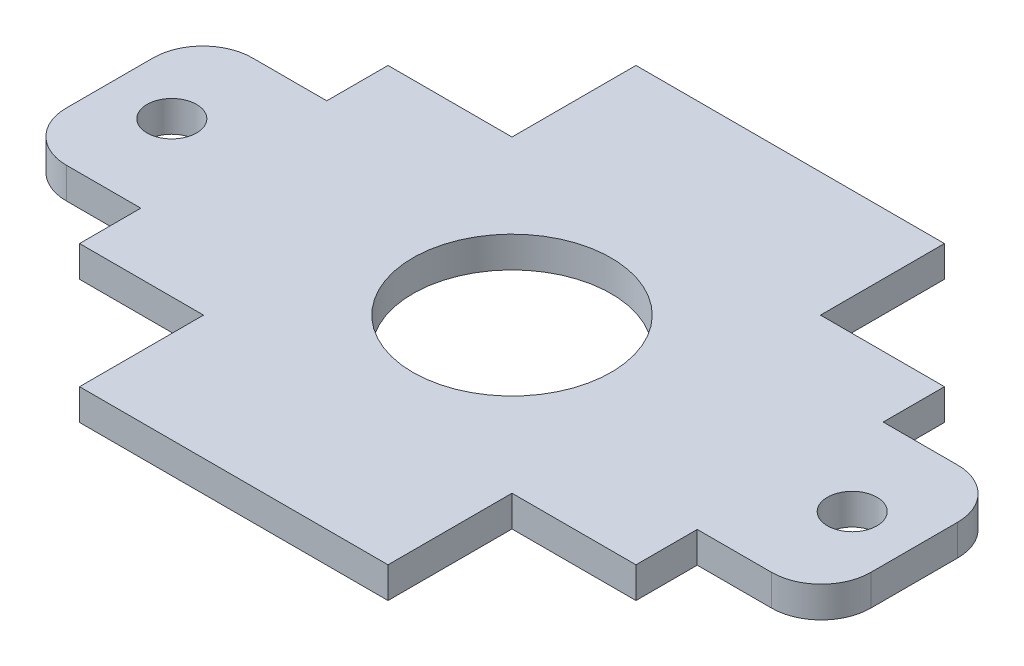
ISO-10303-21;
HEADER;
FILE_DESCRIPTION(('STEP AP214'),'2;1');
FILE_NAME('part.step','',(''),(''),'','','');
FILE_SCHEMA(('AUTOMOTIVE_DESIGN { 1 0 10303 214 1 1 1 1 }'));
ENDSEC;
DATA;
#1=APPLICATION_CONTEXT('core data for automotive mechanical design processes');
#2=APPLICATION_PROTOCOL_DEFINITION('international standard','automotive_design',2000,#1);
#3=PRODUCT_CONTEXT('',#1,'mechanical');
#4=PRODUCT('Part','Part','',(#3));
#5=PRODUCT_RELATED_PRODUCT_CATEGORY('part','',(#4));
#6=PRODUCT_DEFINITION_FORMATION('','',#4);
#7=PRODUCT_DEFINITION_CONTEXT('part definition',#1,'design');
#8=PRODUCT_DEFINITION('design','',#6,#7);
#9=PRODUCT_DEFINITION_SHAPE('','',#8);
#10=(LENGTH_UNIT() NAMED_UNIT(*) SI_UNIT(.MILLI.,.METRE.));
#11=(NAMED_UNIT(*) PLANE_ANGLE_UNIT() SI_UNIT($,.RADIAN.));
#12=(NAMED_UNIT(*) SI_UNIT($,.STERADIAN.) SOLID_ANGLE_UNIT());
#13=UNCERTAINTY_MEASURE_WITH_UNIT(LENGTH_MEASURE(1.E-05),#10,'distance_accuracy_value','');
#14=(GEOMETRIC_REPRESENTATION_CONTEXT(3) GLOBAL_UNCERTAINTY_ASSIGNED_CONTEXT((#13)) GLOBAL_UNIT_ASSIGNED_CONTEXT((#10,
#11,#12)) REPRESENTATION_CONTEXT('',''));
#15=CARTESIAN_POINT('',(0.,0.,0.));
#16=DIRECTION('',(0.,0.,1.));
#17=DIRECTION('',(1.,0.,0.));
#18=AXIS2_PLACEMENT_3D('',#15,#16,#17);
#19=CARTESIAN_POINT('',(-36.1199938,3.175,-4.44499999999998));
#20=DIRECTION('',(0.,1.,0.));
#21=DIRECTION('',(0.,0.,1.));
#22=AXIS2_PLACEMENT_3D('',#19,#20,#21);
#23=PLANE('',#22);
#24=CARTESIAN_POINT('',(-34.8499938,3.175,0.));
#25=DIRECTION('',(0.,1.,0.));
#26=DIRECTION('',(0.,0.,1.));
#27=AXIS2_PLACEMENT_3D('',#24,#25,#26);
#28=CIRCLE('',#27,2.54);
#29=CARTESIAN_POINT('',(-34.8499938,3.175,2.54000000000002));
#30=VERTEX_POINT('',#29);
#31=EDGE_CURVE('E444',#30,#30,#28,.T.);
#32=ORIENTED_EDGE('',*,*,#31,.F.);
#33=EDGE_LOOP('',(#32));
#34=FACE_BOUND('',#33,.T.);
#35=DIRECTION('',(-1.,0.,0.));
#36=VECTOR('',#35,1.);
#37=CARTESIAN_POINT('',(-28.4999938,3.175,-9.52499999999998));
#38=LINE('',#37,#36);
#39=CARTESIAN_POINT('',(-28.4999938,3.175,-9.52499999999998));
#40=VERTEX_POINT('',#39);
#41=CARTESIAN_POINT('',(-36.1199938,3.175,-9.52499999999998));
#42=VERTEX_POINT('',#41);
#43=EDGE_CURVE('E275',#40,#42,#38,.T.);
#44=ORIENTED_EDGE('',*,*,#43,.T.);
#45=CARTESIAN_POINT('',(-36.1199938,3.175,-4.44499999999998));
#46=DIRECTION('',(0.,1.,0.));
#47=DIRECTION('',(0.,0.,1.));
#48=AXIS2_PLACEMENT_3D('',#45,#46,#47);
#49=CIRCLE('',#48,5.08);
#50=CARTESIAN_POINT('',(-41.1999938,3.175,-4.44499999999998));
#51=VERTEX_POINT('',#50);
#52=EDGE_CURVE('E143',#42,#51,#49,.T.);
#53=ORIENTED_EDGE('',*,*,#52,.T.);
#54=DIRECTION('',(0.,0.,1.));
#55=VECTOR('',#54,1.);
#56=CARTESIAN_POINT('',(-41.1999938,3.175,4.44500000000002));
#57=LINE('',#56,#55);
#58=CARTESIAN_POINT('',(-41.1999938,3.175,4.44500000000002));
#59=VERTEX_POINT('',#58);
#60=EDGE_CURVE('E338',#51,#59,#57,.T.);
#61=ORIENTED_EDGE('',*,*,#60,.T.);
#62=CARTESIAN_POINT('',(-36.1199938,3.175,4.44500000000002));
#63=DIRECTION('',(0.,1.,0.));
#64=DIRECTION('',(0.,0.,-1.));
#65=AXIS2_PLACEMENT_3D('',#62,#63,#64);
#66=CIRCLE('',#65,5.08);
#67=CARTESIAN_POINT('',(-36.1199938,3.175,9.52500000000002));
#68=VERTEX_POINT('',#67);
#69=EDGE_CURVE('E357',#59,#68,#66,.T.);
#70=ORIENTED_EDGE('',*,*,#69,.T.);
#71=DIRECTION('',(1.,0.,0.));
#72=VECTOR('',#71,1.);
#73=CARTESIAN_POINT('',(-28.4999938,3.175,9.52500000000002));
#74=LINE('',#73,#72);
#75=CARTESIAN_POINT('',(-28.4999938,3.175,9.52500000000002));
#76=VERTEX_POINT('',#75);
#77=EDGE_CURVE('E354',#68,#76,#74,.T.);
#78=ORIENTED_EDGE('',*,*,#77,.T.);
#79=DIRECTION('',(0.,0.,1.));
#80=VECTOR('',#79,1.);
#81=CARTESIAN_POINT('',(-28.4999938,3.175,9.52500000000002));
#82=LINE('',#81,#80);
#83=CARTESIAN_POINT('',(-28.4999938,3.175,15.7999938));
#84=VERTEX_POINT('',#83);
#85=EDGE_CURVE('E356',#76,#84,#82,.T.);
#86=ORIENTED_EDGE('',*,*,#85,.T.);
#87=DIRECTION('',(1.,0.,0.));
#88=VECTOR('',#87,1.);
#89=CARTESIAN_POINT('',(-15.7999938,3.175,15.7999938));
#90=LINE('',#89,#88);
#91=CARTESIAN_POINT('',(-15.7999938,3.175,15.7999938));
#92=VERTEX_POINT('',#91);
#93=EDGE_CURVE('E359',#84,#92,#90,.T.);
#94=ORIENTED_EDGE('',*,*,#93,.T.);
#95=DIRECTION('',(0.,0.,1.));
#96=VECTOR('',#95,1.);
#97=CARTESIAN_POINT('',(-15.7999938,3.175,15.7999938));
#98=LINE('',#97,#96);
#99=CARTESIAN_POINT('',(-15.7999938,3.175,28.4999938));
#100=VERTEX_POINT('',#99);
#101=EDGE_CURVE('E365',#92,#100,#98,.T.);
#102=ORIENTED_EDGE('',*,*,#101,.T.);
#103=DIRECTION('',(1.,0.,0.));
#104=VECTOR('',#103,1.);
#105=CARTESIAN_POINT('',(15.7999938,3.175,28.4999938));
#106=LINE('',#105,#104);
#107=CARTESIAN_POINT('',(15.7999938,3.175,28.4999938));
#108=VERTEX_POINT('',#107);
#109=EDGE_CURVE('E367',#100,#108,#106,.T.);
#110=ORIENTED_EDGE('',*,*,#109,.T.);
#111=DIRECTION('',(0.,0.,-1.));
#112=VECTOR('',#111,1.);
#113=CARTESIAN_POINT('',(15.7999938,3.175,15.7999938));
#114=LINE('',#113,#112);
#115=CARTESIAN_POINT('',(15.7999938,3.175,15.7999938));
#116=VERTEX_POINT('',#115);
#117=EDGE_CURVE('E369',#108,#116,#114,.T.);
#118=ORIENTED_EDGE('',*,*,#117,.T.);
#119=DIRECTION('',(1.,0.,0.));
#120=VECTOR('',#119,1.);
#121=CARTESIAN_POINT('',(15.7999938,3.175,15.7999938));
#122=LINE('',#121,#120);
#123=CARTESIAN_POINT('',(28.4999938,3.175,15.7999938));
#124=VERTEX_POINT('',#123);
#125=EDGE_CURVE('E371',#116,#124,#122,.T.);
#126=ORIENTED_EDGE('',*,*,#125,.T.);
#127=DIRECTION('',(0.,0.,-1.));
#128=VECTOR('',#127,1.);
#129=CARTESIAN_POINT('',(28.4999938,3.175,9.52500000000002));
#130=LINE('',#129,#128);
#131=CARTESIAN_POINT('',(28.4999938,3.175,9.52500000000002));
#132=VERTEX_POINT('',#131);
#133=EDGE_CURVE('E373',#124,#132,#130,.T.);
#134=ORIENTED_EDGE('',*,*,#133,.T.);
#135=DIRECTION('',(1.,0.,0.));
#136=VECTOR('',#135,1.);
#137=CARTESIAN_POINT('',(28.4999938,3.175,9.52500000000002));
#138=LINE('',#137,#136);
#139=CARTESIAN_POINT('',(36.1199938,3.175,9.52500000000002));
#140=VERTEX_POINT('',#139);
#141=EDGE_CURVE('E375',#132,#140,#138,.T.);
#142=ORIENTED_EDGE('',*,*,#141,.T.);
#143=CARTESIAN_POINT('',(36.1199938,3.175,4.44500000000002));
#144=DIRECTION('',(0.,1.,0.));
#145=DIRECTION('',(0.,0.,1.));
#146=AXIS2_PLACEMENT_3D('',#143,#144,#145);
#147=CIRCLE('',#146,5.08);
#148=CARTESIAN_POINT('',(41.1999938,3.175,4.44500000000002));
#149=VERTEX_POINT('',#148);
#150=EDGE_CURVE('E377',#140,#149,#147,.T.);
#151=ORIENTED_EDGE('',*,*,#150,.T.);
#152=DIRECTION('',(0.,0.,-1.));
#153=VECTOR('',#152,1.);
#154=CARTESIAN_POINT('',(41.1999938,3.175,4.44500000000002));
#155=LINE('',#154,#153);
#156=CARTESIAN_POINT('',(41.1999938,3.175,-4.44499999999999));
#157=VERTEX_POINT('',#156);
#158=EDGE_CURVE('E379',#149,#157,#155,.T.);
#159=ORIENTED_EDGE('',*,*,#158,.T.);
#160=CARTESIAN_POINT('',(36.1199938,3.175,-4.44499999999999));
#161=DIRECTION('',(0.,1.,0.));
#162=DIRECTION('',(0.,0.,1.));
#163=AXIS2_PLACEMENT_3D('',#160,#161,#162);
#164=CIRCLE('',#163,5.08);
#165=CARTESIAN_POINT('',(36.1199938,3.175,-9.52499999999998));
#166=VERTEX_POINT('',#165);
#167=EDGE_CURVE('E381',#157,#166,#164,.T.);
#168=ORIENTED_EDGE('',*,*,#167,.T.);
#169=DIRECTION('',(-1.,0.,0.));
#170=VECTOR('',#169,1.);
#171=CARTESIAN_POINT('',(28.4999938,3.175,-9.52499999999998));
#172=LINE('',#171,#170);
#173=CARTESIAN_POINT('',(28.4999938,3.175,-9.52499999999998));
#174=VERTEX_POINT('',#173);
#175=EDGE_CURVE('E383',#166,#174,#172,.T.);
#176=ORIENTED_EDGE('',*,*,#175,.T.);
#177=DIRECTION('',(0.,0.,-1.));
#178=VECTOR('',#177,1.);
#179=CARTESIAN_POINT('',(28.4999938,3.175,-15.7999938));
#180=LINE('',#179,#178);
#181=CARTESIAN_POINT('',(28.4999938,3.175,-15.7999938));
#182=VERTEX_POINT('',#181);
#183=EDGE_CURVE('E385',#174,#182,#180,.T.);
#184=ORIENTED_EDGE('',*,*,#183,.T.);
#185=DIRECTION('',(-1.,0.,0.));
#186=VECTOR('',#185,1.);
#187=CARTESIAN_POINT('',(15.7999938,3.175,-15.7999938));
#188=LINE('',#187,#186);
#189=CARTESIAN_POINT('',(15.7999938,3.175,-15.7999938));
#190=VERTEX_POINT('',#189);
#191=EDGE_CURVE('E387',#182,#190,#188,.T.);
#192=ORIENTED_EDGE('',*,*,#191,.T.);
#193=DIRECTION('',(0.,0.,-1.));
#194=VECTOR('',#193,1.);
#195=CARTESIAN_POINT('',(15.7999938,3.175,-15.7999938));
#196=LINE('',#195,#194);
#197=CARTESIAN_POINT('',(15.7999938,3.175,-28.4999938));
#198=VERTEX_POINT('',#197);
#199=EDGE_CURVE('E389',#190,#198,#196,.T.);
#200=ORIENTED_EDGE('',*,*,#199,.T.);
#201=DIRECTION('',(-1.,0.,0.));
#202=VECTOR('',#201,1.);
#203=CARTESIAN_POINT('',(-15.7999938,3.175,-28.4999938));
#204=LINE('',#203,#202);
#205=CARTESIAN_POINT('',(-15.7999938,3.175,-28.4999938));
#206=VERTEX_POINT('',#205);
#207=EDGE_CURVE('E210',#198,#206,#204,.T.);
#208=ORIENTED_EDGE('',*,*,#207,.T.);
#209=DIRECTION('',(0.,0.,1.));
#210=VECTOR('',#209,1.);
#211=CARTESIAN_POINT('',(-15.7999938,3.175,-15.7999938));
#212=LINE('',#211,#210);
#213=CARTESIAN_POINT('',(-15.7999938,3.175,-15.7999938));
#214=VERTEX_POINT('',#213);
#215=EDGE_CURVE('E204',#206,#214,#212,.T.);
#216=ORIENTED_EDGE('',*,*,#215,.T.);
#217=DIRECTION('',(-1.,0.,0.));
#218=VECTOR('',#217,1.);
#219=CARTESIAN_POINT('',(-15.7999938,3.175,-15.7999938));
#220=LINE('',#219,#218);
#221=CARTESIAN_POINT('',(-28.4999938,3.175,-15.7999938));
#222=VERTEX_POINT('',#221);
#223=EDGE_CURVE('E208',#214,#222,#220,.T.);
#224=ORIENTED_EDGE('',*,*,#223,.T.);
#225=DIRECTION('',(0.,0.,1.));
#226=VECTOR('',#225,1.);
#227=CARTESIAN_POINT('',(-28.4999938,3.175,-15.7999938));
#228=LINE('',#227,#226);
#229=EDGE_CURVE('E52',#222,#40,#228,.T.);
#230=ORIENTED_EDGE('',*,*,#229,.T.);
#231=EDGE_LOOP('',(#44,#53,#61,#70,#78,#86,#94,#102,#110,#118,#126,#134,#142,#151,#159,#168,
#176,#184,#192,#200,#208,#216,#224,#230));
#232=FACE_BOUND('',#231,.T.);
#233=CARTESIAN_POINT('',(0.,3.175,0.));
#234=DIRECTION('',(0.,1.,0.));
#235=DIRECTION('',(0.,0.,1.));
#236=AXIS2_PLACEMENT_3D('',#233,#234,#235);
#237=CIRCLE('',#236,10.16);
#238=CARTESIAN_POINT('',(0.,3.175,10.16));
#239=VERTEX_POINT('',#238);
#240=EDGE_CURVE('E232',#239,#239,#237,.T.);
#241=ORIENTED_EDGE('',*,*,#240,.F.);
#242=EDGE_LOOP('',(#241));
#243=FACE_BOUND('',#242,.T.);
#244=CARTESIAN_POINT('',(34.8499938,3.175,0.));
#245=DIRECTION('',(0.,1.,0.));
#246=DIRECTION('',(0.,0.,-1.));
#247=AXIS2_PLACEMENT_3D('',#244,#245,#246);
#248=CIRCLE('',#247,2.54000000000002);
#249=CARTESIAN_POINT('',(34.8499938,3.175,-2.54));
#250=VERTEX_POINT('',#249);
#251=EDGE_CURVE('E435',#250,#250,#248,.T.);
#252=ORIENTED_EDGE('',*,*,#251,.F.);
#253=EDGE_LOOP('',(#252));
#254=FACE_BOUND('',#253,.T.);
#255=ADVANCED_FACE('F35',(#34,#232,#243,#254),#23,.T.);
#256=CARTESIAN_POINT('',(-36.1199938,0.,-4.44499999999998));
#257=DIRECTION('',(0.,1.,0.));
#258=DIRECTION('',(0.,0.,1.));
#259=AXIS2_PLACEMENT_3D('',#256,#257,#258);
#260=PLANE('',#259);
#261=DIRECTION('',(-1.,0.,0.));
#262=VECTOR('',#261,1.);
#263=CARTESIAN_POINT('',(-28.4999938,0.,-9.52499999999998));
#264=LINE('',#263,#262);
#265=CARTESIAN_POINT('',(-28.4999938,0.,-9.52499999999998));
#266=VERTEX_POINT('',#265);
#267=CARTESIAN_POINT('',(-36.1199938,0.,-9.52499999999998));
#268=VERTEX_POINT('',#267);
#269=EDGE_CURVE('E228',#266,#268,#264,.T.);
#270=ORIENTED_EDGE('',*,*,#269,.F.);
#271=DIRECTION('',(0.,0.,1.));
#272=VECTOR('',#271,1.);
#273=CARTESIAN_POINT('',(-28.4999938,0.,-15.7999938));
#274=LINE('',#273,#272);
#275=CARTESIAN_POINT('',(-28.4999938,0.,-15.7999938));
#276=VERTEX_POINT('',#275);
#277=EDGE_CURVE('E135',#276,#266,#274,.T.);
#278=ORIENTED_EDGE('',*,*,#277,.F.);
#279=DIRECTION('',(-1.,0.,0.));
#280=VECTOR('',#279,1.);
#281=CARTESIAN_POINT('',(-15.7999938,0.,-15.7999938));
#282=LINE('',#281,#280);
#283=CARTESIAN_POINT('',(-15.7999938,0.,-15.7999938));
#284=VERTEX_POINT('',#283);
#285=EDGE_CURVE('E129',#284,#276,#282,.T.);
#286=ORIENTED_EDGE('',*,*,#285,.F.);
#287=DIRECTION('',(0.,0.,1.));
#288=VECTOR('',#287,1.);
#289=CARTESIAN_POINT('',(-15.7999938,0.,-15.7999938));
#290=LINE('',#289,#288);
#291=CARTESIAN_POINT('',(-15.7999938,0.,-28.4999938));
#292=VERTEX_POINT('',#291);
#293=EDGE_CURVE('E218',#292,#284,#290,.T.);
#294=ORIENTED_EDGE('',*,*,#293,.F.);
#295=DIRECTION('',(-1.,0.,0.));
#296=VECTOR('',#295,1.);
#297=CARTESIAN_POINT('',(-15.7999938,0.,-28.4999938));
#298=LINE('',#297,#296);
#299=CARTESIAN_POINT('',(15.7999938,0.,-28.4999938));
#300=VERTEX_POINT('',#299);
#301=EDGE_CURVE('E270',#300,#292,#298,.T.);
#302=ORIENTED_EDGE('',*,*,#301,.F.);
#303=DIRECTION('',(0.,0.,-1.));
#304=VECTOR('',#303,1.);
#305=CARTESIAN_POINT('',(15.7999938,0.,-15.7999938));
#306=LINE('',#305,#304);
#307=CARTESIAN_POINT('',(15.7999938,0.,-15.7999938));
#308=VERTEX_POINT('',#307);
#309=EDGE_CURVE('E268',#308,#300,#306,.T.);
#310=ORIENTED_EDGE('',*,*,#309,.F.);
#311=DIRECTION('',(-1.,0.,0.));
#312=VECTOR('',#311,1.);
#313=CARTESIAN_POINT('',(15.7999938,0.,-15.7999938));
#314=LINE('',#313,#312);
#315=CARTESIAN_POINT('',(28.4999938,0.,-15.7999938));
#316=VERTEX_POINT('',#315);
#317=EDGE_CURVE('E266',#316,#308,#314,.T.);
#318=ORIENTED_EDGE('',*,*,#317,.F.);
#319=DIRECTION('',(0.,0.,-1.));
#320=VECTOR('',#319,1.);
#321=CARTESIAN_POINT('',(28.4999938,0.,-15.7999938));
#322=LINE('',#321,#320);
#323=CARTESIAN_POINT('',(28.4999938,0.,-9.52499999999998));
#324=VERTEX_POINT('',#323);
#325=EDGE_CURVE('E264',#324,#316,#322,.T.);
#326=ORIENTED_EDGE('',*,*,#325,.F.);
#327=DIRECTION('',(-1.,0.,0.));
#328=VECTOR('',#327,1.);
#329=CARTESIAN_POINT('',(28.4999938,0.,-9.52499999999998));
#330=LINE('',#329,#328);
#331=CARTESIAN_POINT('',(36.1199938,0.,-9.52499999999998));
#332=VERTEX_POINT('',#331);
#333=EDGE_CURVE('E262',#332,#324,#330,.T.);
#334=ORIENTED_EDGE('',*,*,#333,.F.);
#335=CARTESIAN_POINT('',(36.1199938,0.,-4.44499999999999));
#336=DIRECTION('',(0.,1.,0.));
#337=DIRECTION('',(0.,0.,1.));
#338=AXIS2_PLACEMENT_3D('',#335,#336,#337);
#339=CIRCLE('',#338,5.08);
#340=CARTESIAN_POINT('',(41.1999938,0.,-4.44499999999999));
#341=VERTEX_POINT('',#340);
#342=EDGE_CURVE('E260',#341,#332,#339,.T.);
#343=ORIENTED_EDGE('',*,*,#342,.F.);
#344=DIRECTION('',(0.,0.,-1.));
#345=VECTOR('',#344,1.);
#346=CARTESIAN_POINT('',(41.1999938,0.,4.44500000000002));
#347=LINE('',#346,#345);
#348=CARTESIAN_POINT('',(41.1999938,0.,4.44500000000002));
#349=VERTEX_POINT('',#348);
#350=EDGE_CURVE('E258',#349,#341,#347,.T.);
#351=ORIENTED_EDGE('',*,*,#350,.F.);
#352=CARTESIAN_POINT('',(36.1199938,0.,4.44500000000002));
#353=DIRECTION('',(0.,1.,0.));
#354=DIRECTION('',(0.,0.,1.));
#355=AXIS2_PLACEMENT_3D('',#352,#353,#354);
#356=CIRCLE('',#355,5.08);
#357=CARTESIAN_POINT('',(36.1199938,0.,9.52500000000002));
#358=VERTEX_POINT('',#357);
#359=EDGE_CURVE('E256',#358,#349,#356,.T.);
#360=ORIENTED_EDGE('',*,*,#359,.F.);
#361=DIRECTION('',(1.,0.,0.));
#362=VECTOR('',#361,1.);
#363=CARTESIAN_POINT('',(28.4999938,0.,9.52500000000002));
#364=LINE('',#363,#362);
#365=CARTESIAN_POINT('',(28.4999938,0.,9.52500000000002));
#366=VERTEX_POINT('',#365);
#367=EDGE_CURVE('E254',#366,#358,#364,.T.);
#368=ORIENTED_EDGE('',*,*,#367,.F.);
#369=DIRECTION('',(0.,0.,-1.));
#370=VECTOR('',#369,1.);
#371=CARTESIAN_POINT('',(28.4999938,0.,9.52500000000002));
#372=LINE('',#371,#370);
#373=CARTESIAN_POINT('',(28.4999938,0.,15.7999938));
#374=VERTEX_POINT('',#373);
#375=EDGE_CURVE('E252',#374,#366,#372,.T.);
#376=ORIENTED_EDGE('',*,*,#375,.F.);
#377=DIRECTION('',(1.,0.,0.));
#378=VECTOR('',#377,1.);
#379=CARTESIAN_POINT('',(15.7999938,0.,15.7999938));
#380=LINE('',#379,#378);
#381=CARTESIAN_POINT('',(15.7999938,0.,15.7999938));
#382=VERTEX_POINT('',#381);
#383=EDGE_CURVE('E250',#382,#374,#380,.T.);
#384=ORIENTED_EDGE('',*,*,#383,.F.);
#385=DIRECTION('',(0.,0.,-1.));
#386=VECTOR('',#385,1.);
#387=CARTESIAN_POINT('',(15.7999938,0.,15.7999938));
#388=LINE('',#387,#386);
#389=CARTESIAN_POINT('',(15.7999938,0.,28.4999938));
#390=VERTEX_POINT('',#389);
#391=EDGE_CURVE('E248',#390,#382,#388,.T.);
#392=ORIENTED_EDGE('',*,*,#391,.F.);
#393=DIRECTION('',(1.,0.,0.));
#394=VECTOR('',#393,1.);
#395=CARTESIAN_POINT('',(15.7999938,0.,28.4999938));
#396=LINE('',#395,#394);
#397=CARTESIAN_POINT('',(-15.7999938,0.,28.4999938));
#398=VERTEX_POINT('',#397);
#399=EDGE_CURVE('E246',#398,#390,#396,.T.);
#400=ORIENTED_EDGE('',*,*,#399,.F.);
#401=DIRECTION('',(0.,0.,1.));
#402=VECTOR('',#401,1.);
#403=CARTESIAN_POINT('',(-15.7999938,0.,15.7999938));
#404=LINE('',#403,#402);
#405=CARTESIAN_POINT('',(-15.7999938,0.,15.7999938));
#406=VERTEX_POINT('',#405);
#407=EDGE_CURVE('E244',#406,#398,#404,.T.);
#408=ORIENTED_EDGE('',*,*,#407,.F.);
#409=DIRECTION('',(1.,0.,0.));
#410=VECTOR('',#409,1.);
#411=CARTESIAN_POINT('',(-15.7999938,0.,15.7999938));
#412=LINE('',#411,#410);
#413=CARTESIAN_POINT('',(-28.4999938,0.,15.7999938));
#414=VERTEX_POINT('',#413);
#415=EDGE_CURVE('E242',#414,#406,#412,.T.);
#416=ORIENTED_EDGE('',*,*,#415,.F.);
#417=DIRECTION('',(0.,0.,1.));
#418=VECTOR('',#417,1.);
#419=CARTESIAN_POINT('',(-28.4999938,0.,9.52500000000002));
#420=LINE('',#419,#418);
#421=CARTESIAN_POINT('',(-28.4999938,0.,9.52500000000002));
#422=VERTEX_POINT('',#421);
#423=EDGE_CURVE('E240',#422,#414,#420,.T.);
#424=ORIENTED_EDGE('',*,*,#423,.F.);
#425=DIRECTION('',(1.,0.,0.));
#426=VECTOR('',#425,1.);
#427=CARTESIAN_POINT('',(-28.4999938,0.,9.52500000000002));
#428=LINE('',#427,#426);
#429=CARTESIAN_POINT('',(-36.1199938,0.,9.52500000000002));
#430=VERTEX_POINT('',#429);
#431=EDGE_CURVE('E238',#430,#422,#428,.T.);
#432=ORIENTED_EDGE('',*,*,#431,.F.);
#433=CARTESIAN_POINT('',(-36.1199938,0.,4.44500000000002));
#434=DIRECTION('',(0.,1.,0.));
#435=DIRECTION('',(0.,0.,-1.));
#436=AXIS2_PLACEMENT_3D('',#433,#434,#435);
#437=CIRCLE('',#436,5.08);
#438=CARTESIAN_POINT('',(-41.1999938,0.,4.44500000000002));
#439=VERTEX_POINT('',#438);
#440=EDGE_CURVE('E236',#439,#430,#437,.T.);
#441=ORIENTED_EDGE('',*,*,#440,.F.);
#442=DIRECTION('',(0.,0.,1.));
#443=VECTOR('',#442,1.);
#444=CARTESIAN_POINT('',(-41.1999938,0.,4.44500000000002));
#445=LINE('',#444,#443);
#446=CARTESIAN_POINT('',(-41.1999938,0.,-4.44499999999998));
#447=VERTEX_POINT('',#446);
#448=EDGE_CURVE('E234',#447,#439,#445,.T.);
#449=ORIENTED_EDGE('',*,*,#448,.F.);
#450=CARTESIAN_POINT('',(-36.1199938,0.,-4.44499999999998));
#451=DIRECTION('',(0.,1.,0.));
#452=DIRECTION('',(0.,0.,1.));
#453=AXIS2_PLACEMENT_3D('',#450,#451,#452);
#454=CIRCLE('',#453,5.08);
#455=EDGE_CURVE('E231',#268,#447,#454,.T.);
#456=ORIENTED_EDGE('',*,*,#455,.F.);
#457=EDGE_LOOP('',(#270,#278,#286,#294,#302,#310,#318,#326,#334,#343,#351,#360,#368,#376,#384,
#392,#400,#408,#416,#424,#432,#441,#449,#456));
#458=FACE_BOUND('',#457,.T.);
#459=CARTESIAN_POINT('',(0.,0.,0.));
#460=DIRECTION('',(0.,1.,0.));
#461=DIRECTION('',(0.,0.,1.));
#462=AXIS2_PLACEMENT_3D('',#459,#460,#461);
#463=CIRCLE('',#462,10.16);
#464=CARTESIAN_POINT('',(0.,0.,10.16));
#465=VERTEX_POINT('',#464);
#466=EDGE_CURVE('E447',#465,#465,#463,.T.);
#467=ORIENTED_EDGE('',*,*,#466,.T.);
#468=EDGE_LOOP('',(#467));
#469=FACE_BOUND('',#468,.T.);
#470=CARTESIAN_POINT('',(-34.8499938,0.,0.));
#471=DIRECTION('',(0.,1.,0.));
#472=DIRECTION('',(0.,0.,1.));
#473=AXIS2_PLACEMENT_3D('',#470,#471,#472);
#474=CIRCLE('',#473,2.54);
#475=CARTESIAN_POINT('',(-34.8499938,0.,2.54000000000002));
#476=VERTEX_POINT('',#475);
#477=EDGE_CURVE('E441',#476,#476,#474,.T.);
#478=ORIENTED_EDGE('',*,*,#477,.T.);
#479=EDGE_LOOP('',(#478));
#480=FACE_BOUND('',#479,.T.);
#481=CARTESIAN_POINT('',(34.8499938,0.,0.));
#482=DIRECTION('',(0.,1.,0.));
#483=DIRECTION('',(0.,0.,-1.));
#484=AXIS2_PLACEMENT_3D('',#481,#482,#483);
#485=CIRCLE('',#484,2.54000000000002);
#486=CARTESIAN_POINT('',(34.8499938,0.,-2.54));
#487=VERTEX_POINT('',#486);
#488=EDGE_CURVE('E438',#487,#487,#485,.T.);
#489=ORIENTED_EDGE('',*,*,#488,.T.);
#490=EDGE_LOOP('',(#489));
#491=FACE_BOUND('',#490,.T.);
#492=ADVANCED_FACE('F342',(#458,#469,#480,#491),#260,.F.);
#493=CARTESIAN_POINT('',(-28.4999938,3.175,-9.52499999999998));
#494=DIRECTION('',(0.,0.,1.));
#495=DIRECTION('',(1.,0.,0.));
#496=AXIS2_PLACEMENT_3D('',#493,#494,#495);
#497=PLANE('',#496);
#498=ORIENTED_EDGE('',*,*,#269,.T.);
#499=DIRECTION('',(0.,-1.,0.));
#500=VECTOR('',#499,1.);
#501=CARTESIAN_POINT('',(-36.1199938,3.175,-9.52499999999998));
#502=LINE('',#501,#500);
#503=EDGE_CURVE('E11',#42,#268,#502,.T.);
#504=ORIENTED_EDGE('',*,*,#503,.F.);
#505=ORIENTED_EDGE('',*,*,#43,.F.);
#506=DIRECTION('',(0.,-1.,0.));
#507=VECTOR('',#506,1.);
#508=CARTESIAN_POINT('',(-28.4999938,3.175,-9.52499999999998));
#509=LINE('',#508,#507);
#510=EDGE_CURVE('E224',#40,#266,#509,.T.);
#511=ORIENTED_EDGE('',*,*,#510,.T.);
#512=EDGE_LOOP('',(#498,#504,#505,#511));
#513=FACE_BOUND('',#512,.T.);
#514=ADVANCED_FACE('F37',(#513),#497,.F.);
#515=CARTESIAN_POINT('',(-36.1199938,3.175,-4.44499999999998));
#516=DIRECTION('',(0.,-1.,0.));
#517=DIRECTION('',(0.,0.,-1.));
#518=AXIS2_PLACEMENT_3D('',#515,#516,#517);
#519=CYLINDRICAL_SURFACE('',#518,5.08);
#520=ORIENTED_EDGE('',*,*,#455,.T.);
#521=DIRECTION('',(0.,-1.,0.));
#522=VECTOR('',#521,1.);
#523=CARTESIAN_POINT('',(-41.1999938,3.175,-4.44499999999998));
#524=LINE('',#523,#522);
#525=EDGE_CURVE('E44',#51,#447,#524,.T.);
#526=ORIENTED_EDGE('',*,*,#525,.F.);
#527=ORIENTED_EDGE('',*,*,#52,.F.);
#528=ORIENTED_EDGE('',*,*,#503,.T.);
#529=EDGE_LOOP('',(#520,#526,#527,#528));
#530=FACE_BOUND('',#529,.T.);
#531=ADVANCED_FACE('F669',(#530),#519,.T.);
#532=CARTESIAN_POINT('',(-41.1999938,3.175,4.44500000000002));
#533=DIRECTION('',(1.,0.,0.));
#534=DIRECTION('',(0.,0.,-1.));
#535=AXIS2_PLACEMENT_3D('',#532,#533,#534);
#536=PLANE('',#535);
#537=ORIENTED_EDGE('',*,*,#448,.T.);
#538=DIRECTION('',(0.,-1.,0.));
#539=VECTOR('',#538,1.);
#540=CARTESIAN_POINT('',(-41.1999938,3.175,4.44500000000002));
#541=LINE('',#540,#539);
#542=EDGE_CURVE('E330',#59,#439,#541,.T.);
#543=ORIENTED_EDGE('',*,*,#542,.F.);
#544=ORIENTED_EDGE('',*,*,#60,.F.);
#545=ORIENTED_EDGE('',*,*,#525,.T.);
#546=EDGE_LOOP('',(#537,#543,#544,#545));
#547=FACE_BOUND('',#546,.T.);
#548=ADVANCED_FACE('F336',(#547),#536,.F.);
#549=CARTESIAN_POINT('',(-36.1199938,3.175,4.44500000000002));
#550=DIRECTION('',(0.,-1.,0.));
#551=DIRECTION('',(0.,0.,-1.));
#552=AXIS2_PLACEMENT_3D('',#549,#550,#551);
#553=CYLINDRICAL_SURFACE('',#552,5.08);
#554=ORIENTED_EDGE('',*,*,#440,.T.);
#555=DIRECTION('',(0.,-1.,0.));
#556=VECTOR('',#555,1.);
#557=CARTESIAN_POINT('',(-36.1199938,3.175,9.52500000000002));
#558=LINE('',#557,#556);
#559=EDGE_CURVE('E327',#68,#430,#558,.T.);
#560=ORIENTED_EDGE('',*,*,#559,.F.);
#561=ORIENTED_EDGE('',*,*,#69,.F.);
#562=ORIENTED_EDGE('',*,*,#542,.T.);
#563=EDGE_LOOP('',(#554,#560,#561,#562));
#564=FACE_BOUND('',#563,.T.);
#565=ADVANCED_FACE('F348',(#564),#553,.T.);
#566=CARTESIAN_POINT('',(-28.4999938,3.175,9.52500000000002));
#567=DIRECTION('',(0.,0.,-1.));
#568=DIRECTION('',(-1.,0.,0.));
#569=AXIS2_PLACEMENT_3D('',#566,#567,#568);
#570=PLANE('',#569);
#571=ORIENTED_EDGE('',*,*,#431,.T.);
#572=DIRECTION('',(0.,-1.,0.));
#573=VECTOR('',#572,1.);
#574=CARTESIAN_POINT('',(-28.4999938,3.175,9.52500000000002));
#575=LINE('',#574,#573);
#576=EDGE_CURVE('E324',#76,#422,#575,.T.);
#577=ORIENTED_EDGE('',*,*,#576,.F.);
#578=ORIENTED_EDGE('',*,*,#77,.F.);
#579=ORIENTED_EDGE('',*,*,#559,.T.);
#580=EDGE_LOOP('',(#571,#577,#578,#579));
#581=FACE_BOUND('',#580,.T.);
#582=ADVANCED_FACE('F352',(#581),#570,.F.);
#583=CARTESIAN_POINT('',(-28.4999938,3.175,9.52500000000002));
#584=DIRECTION('',(1.,0.,0.));
#585=DIRECTION('',(0.,0.,-1.));
#586=AXIS2_PLACEMENT_3D('',#583,#584,#585);
#587=PLANE('',#586);
#588=ORIENTED_EDGE('',*,*,#423,.T.);
#589=DIRECTION('',(0.,-1.,0.));
#590=VECTOR('',#589,1.);
#591=CARTESIAN_POINT('',(-28.4999938,3.175,15.7999938));
#592=LINE('',#591,#590);
#593=EDGE_CURVE('E321',#84,#414,#592,.T.);
#594=ORIENTED_EDGE('',*,*,#593,.F.);
#595=ORIENTED_EDGE('',*,*,#85,.F.);
#596=ORIENTED_EDGE('',*,*,#576,.T.);
#597=EDGE_LOOP('',(#588,#594,#595,#596));
#598=FACE_BOUND('',#597,.T.);
#599=ADVANCED_FACE('F634',(#598),#587,.F.);
#600=CARTESIAN_POINT('',(-15.7999938,3.175,15.7999938));
#601=DIRECTION('',(0.,0.,-1.));
#602=DIRECTION('',(-1.,0.,0.));
#603=AXIS2_PLACEMENT_3D('',#600,#601,#602);
#604=PLANE('',#603);
#605=ORIENTED_EDGE('',*,*,#415,.T.);
#606=DIRECTION('',(0.,-1.,0.));
#607=VECTOR('',#606,1.);
#608=CARTESIAN_POINT('',(-15.7999938,3.175,15.7999938));
#609=LINE('',#608,#607);
#610=EDGE_CURVE('E318',#92,#406,#609,.T.);
#611=ORIENTED_EDGE('',*,*,#610,.F.);
#612=ORIENTED_EDGE('',*,*,#93,.F.);
#613=ORIENTED_EDGE('',*,*,#593,.T.);
#614=EDGE_LOOP('',(#605,#611,#612,#613));
#615=FACE_BOUND('',#614,.T.);
#616=ADVANCED_FACE('F624',(#615),#604,.F.);
#617=CARTESIAN_POINT('',(-15.7999938,3.175,15.7999938));
#618=DIRECTION('',(1.,0.,0.));
#619=DIRECTION('',(0.,0.,-1.));
#620=AXIS2_PLACEMENT_3D('',#617,#618,#619);
#621=PLANE('',#620);
#622=ORIENTED_EDGE('',*,*,#407,.T.);
#623=DIRECTION('',(0.,-1.,0.));
#624=VECTOR('',#623,1.);
#625=CARTESIAN_POINT('',(-15.7999938,3.175,28.4999938));
#626=LINE('',#625,#624);
#627=EDGE_CURVE('E315',#100,#398,#626,.T.);
#628=ORIENTED_EDGE('',*,*,#627,.F.);
#629=ORIENTED_EDGE('',*,*,#101,.F.);
#630=ORIENTED_EDGE('',*,*,#610,.T.);
#631=EDGE_LOOP('',(#622,#628,#629,#630));
#632=FACE_BOUND('',#631,.T.);
#633=ADVANCED_FACE('F614',(#632),#621,.F.);
#634=CARTESIAN_POINT('',(15.7999938,3.175,28.4999938));
#635=DIRECTION('',(0.,0.,-1.));
#636=DIRECTION('',(-1.,0.,0.));
#637=AXIS2_PLACEMENT_3D('',#634,#635,#636);
#638=PLANE('',#637);
#639=ORIENTED_EDGE('',*,*,#399,.T.);
#640=DIRECTION('',(0.,-1.,0.));
#641=VECTOR('',#640,1.);
#642=CARTESIAN_POINT('',(15.7999938,3.175,28.4999938));
#643=LINE('',#642,#641);
#644=EDGE_CURVE('E312',#108,#390,#643,.T.);
#645=ORIENTED_EDGE('',*,*,#644,.F.);
#646=ORIENTED_EDGE('',*,*,#109,.F.);
#647=ORIENTED_EDGE('',*,*,#627,.T.);
#648=EDGE_LOOP('',(#639,#645,#646,#647));
#649=FACE_BOUND('',#648,.T.);
#650=ADVANCED_FACE('F604',(#649),#638,.F.);
#651=CARTESIAN_POINT('',(15.7999938,3.175,15.7999938));
#652=DIRECTION('',(-1.,0.,0.));
#653=DIRECTION('',(0.,0.,1.));
#654=AXIS2_PLACEMENT_3D('',#651,#652,#653);
#655=PLANE('',#654);
#656=ORIENTED_EDGE('',*,*,#391,.T.);
#657=DIRECTION('',(0.,-1.,0.));
#658=VECTOR('',#657,1.);
#659=CARTESIAN_POINT('',(15.7999938,3.175,15.7999938));
#660=LINE('',#659,#658);
#661=EDGE_CURVE('E309',#116,#382,#660,.T.);
#662=ORIENTED_EDGE('',*,*,#661,.F.);
#663=ORIENTED_EDGE('',*,*,#117,.F.);
#664=ORIENTED_EDGE('',*,*,#644,.T.);
#665=EDGE_LOOP('',(#656,#662,#663,#664));
#666=FACE_BOUND('',#665,.T.);
#667=ADVANCED_FACE('F594',(#666),#655,.F.);
#668=CARTESIAN_POINT('',(15.7999938,3.175,15.7999938));
#669=DIRECTION('',(0.,0.,-1.));
#670=DIRECTION('',(-1.,0.,0.));
#671=AXIS2_PLACEMENT_3D('',#668,#669,#670);
#672=PLANE('',#671);
#673=ORIENTED_EDGE('',*,*,#383,.T.);
#674=DIRECTION('',(0.,-1.,0.));
#675=VECTOR('',#674,1.);
#676=CARTESIAN_POINT('',(28.4999938,3.175,15.7999938));
#677=LINE('',#676,#675);
#678=EDGE_CURVE('E306',#124,#374,#677,.T.);
#679=ORIENTED_EDGE('',*,*,#678,.F.);
#680=ORIENTED_EDGE('',*,*,#125,.F.);
#681=ORIENTED_EDGE('',*,*,#661,.T.);
#682=EDGE_LOOP('',(#673,#679,#680,#681));
#683=FACE_BOUND('',#682,.T.);
#684=ADVANCED_FACE('F584',(#683),#672,.F.);
#685=CARTESIAN_POINT('',(28.4999938,3.175,9.52500000000002));
#686=DIRECTION('',(-1.,0.,0.));
#687=DIRECTION('',(0.,0.,1.));
#688=AXIS2_PLACEMENT_3D('',#685,#686,#687);
#689=PLANE('',#688);
#690=ORIENTED_EDGE('',*,*,#375,.T.);
#691=DIRECTION('',(0.,-1.,0.));
#692=VECTOR('',#691,1.);
#693=CARTESIAN_POINT('',(28.4999938,3.175,9.52500000000002));
#694=LINE('',#693,#692);
#695=EDGE_CURVE('E303',#132,#366,#694,.T.);
#696=ORIENTED_EDGE('',*,*,#695,.F.);
#697=ORIENTED_EDGE('',*,*,#133,.F.);
#698=ORIENTED_EDGE('',*,*,#678,.T.);
#699=EDGE_LOOP('',(#690,#696,#697,#698));
#700=FACE_BOUND('',#699,.T.);
#701=ADVANCED_FACE('F574',(#700),#689,.F.);
#702=CARTESIAN_POINT('',(28.4999938,3.175,9.52500000000002));
#703=DIRECTION('',(0.,0.,-1.));
#704=DIRECTION('',(-1.,0.,0.));
#705=AXIS2_PLACEMENT_3D('',#702,#703,#704);
#706=PLANE('',#705);
#707=ORIENTED_EDGE('',*,*,#367,.T.);
#708=DIRECTION('',(0.,-1.,0.));
#709=VECTOR('',#708,1.);
#710=CARTESIAN_POINT('',(36.1199938,3.175,9.52500000000002));
#711=LINE('',#710,#709);
#712=EDGE_CURVE('E300',#140,#358,#711,.T.);
#713=ORIENTED_EDGE('',*,*,#712,.F.);
#714=ORIENTED_EDGE('',*,*,#141,.F.);
#715=ORIENTED_EDGE('',*,*,#695,.T.);
#716=EDGE_LOOP('',(#707,#713,#714,#715));
#717=FACE_BOUND('',#716,.T.);
#718=ADVANCED_FACE('F564',(#717),#706,.F.);
#719=CARTESIAN_POINT('',(36.1199938,3.175,4.44500000000002));
#720=DIRECTION('',(0.,-1.,0.));
#721=DIRECTION('',(0.,0.,-1.));
#722=AXIS2_PLACEMENT_3D('',#719,#720,#721);
#723=CYLINDRICAL_SURFACE('',#722,5.08);
#724=ORIENTED_EDGE('',*,*,#359,.T.);
#725=DIRECTION('',(0.,-1.,0.));
#726=VECTOR('',#725,1.);
#727=CARTESIAN_POINT('',(41.1999938,3.175,4.44500000000002));
#728=LINE('',#727,#726);
#729=EDGE_CURVE('E297',#149,#349,#728,.T.);
#730=ORIENTED_EDGE('',*,*,#729,.F.);
#731=ORIENTED_EDGE('',*,*,#150,.F.);
#732=ORIENTED_EDGE('',*,*,#712,.T.);
#733=EDGE_LOOP('',(#724,#730,#731,#732));
#734=FACE_BOUND('',#733,.T.);
#735=ADVANCED_FACE('F554',(#734),#723,.T.);
#736=CARTESIAN_POINT('',(41.1999938,3.175,4.44500000000002));
#737=DIRECTION('',(-1.,0.,0.));
#738=DIRECTION('',(0.,0.,1.));
#739=AXIS2_PLACEMENT_3D('',#736,#737,#738);
#740=PLANE('',#739);
#741=ORIENTED_EDGE('',*,*,#350,.T.);
#742=DIRECTION('',(0.,-1.,0.));
#743=VECTOR('',#742,1.);
#744=CARTESIAN_POINT('',(41.1999938,3.175,-4.44499999999999));
#745=LINE('',#744,#743);
#746=EDGE_CURVE('E294',#157,#341,#745,.T.);
#747=ORIENTED_EDGE('',*,*,#746,.F.);
#748=ORIENTED_EDGE('',*,*,#158,.F.);
#749=ORIENTED_EDGE('',*,*,#729,.T.);
#750=EDGE_LOOP('',(#741,#747,#748,#749));
#751=FACE_BOUND('',#750,.T.);
#752=ADVANCED_FACE('F544',(#751),#740,.F.);
#753=CARTESIAN_POINT('',(36.1199938,3.175,-4.44499999999999));
#754=DIRECTION('',(0.,-1.,0.));
#755=DIRECTION('',(0.,0.,-1.));
#756=AXIS2_PLACEMENT_3D('',#753,#754,#755);
#757=CYLINDRICAL_SURFACE('',#756,5.08);
#758=ORIENTED_EDGE('',*,*,#342,.T.);
#759=DIRECTION('',(0.,-1.,0.));
#760=VECTOR('',#759,1.);
#761=CARTESIAN_POINT('',(36.1199938,3.175,-9.52499999999998));
#762=LINE('',#761,#760);
#763=EDGE_CURVE('E291',#166,#332,#762,.T.);
#764=ORIENTED_EDGE('',*,*,#763,.F.);
#765=ORIENTED_EDGE('',*,*,#167,.F.);
#766=ORIENTED_EDGE('',*,*,#746,.T.);
#767=EDGE_LOOP('',(#758,#764,#765,#766));
#768=FACE_BOUND('',#767,.T.);
#769=ADVANCED_FACE('F534',(#768),#757,.T.);
#770=CARTESIAN_POINT('',(28.4999938,3.175,-9.52499999999998));
#771=DIRECTION('',(0.,0.,1.));
#772=DIRECTION('',(1.,0.,0.));
#773=AXIS2_PLACEMENT_3D('',#770,#771,#772);
#774=PLANE('',#773);
#775=ORIENTED_EDGE('',*,*,#333,.T.);
#776=DIRECTION('',(0.,-1.,0.));
#777=VECTOR('',#776,1.);
#778=CARTESIAN_POINT('',(28.4999938,3.175,-9.52499999999998));
#779=LINE('',#778,#777);
#780=EDGE_CURVE('E288',#174,#324,#779,.T.);
#781=ORIENTED_EDGE('',*,*,#780,.F.);
#782=ORIENTED_EDGE('',*,*,#175,.F.);
#783=ORIENTED_EDGE('',*,*,#763,.T.);
#784=EDGE_LOOP('',(#775,#781,#782,#783));
#785=FACE_BOUND('',#784,.T.);
#786=ADVANCED_FACE('F524',(#785),#774,.F.);
#787=CARTESIAN_POINT('',(28.4999938,3.175,-15.7999938));
#788=DIRECTION('',(-1.,0.,0.));
#789=DIRECTION('',(0.,0.,1.));
#790=AXIS2_PLACEMENT_3D('',#787,#788,#789);
#791=PLANE('',#790);
#792=ORIENTED_EDGE('',*,*,#325,.T.);
#793=DIRECTION('',(0.,-1.,0.));
#794=VECTOR('',#793,1.);
#795=CARTESIAN_POINT('',(28.4999938,3.175,-15.7999938));
#796=LINE('',#795,#794);
#797=EDGE_CURVE('E285',#182,#316,#796,.T.);
#798=ORIENTED_EDGE('',*,*,#797,.F.);
#799=ORIENTED_EDGE('',*,*,#183,.F.);
#800=ORIENTED_EDGE('',*,*,#780,.T.);
#801=EDGE_LOOP('',(#792,#798,#799,#800));
#802=FACE_BOUND('',#801,.T.);
#803=ADVANCED_FACE('F514',(#802),#791,.F.);
#804=CARTESIAN_POINT('',(15.7999938,3.175,-15.7999938));
#805=DIRECTION('',(0.,0.,1.));
#806=DIRECTION('',(1.,0.,0.));
#807=AXIS2_PLACEMENT_3D('',#804,#805,#806);
#808=PLANE('',#807);
#809=ORIENTED_EDGE('',*,*,#317,.T.);
#810=DIRECTION('',(0.,-1.,0.));
#811=VECTOR('',#810,1.);
#812=CARTESIAN_POINT('',(15.7999938,3.175,-15.7999938));
#813=LINE('',#812,#811);
#814=EDGE_CURVE('E282',#190,#308,#813,.T.);
#815=ORIENTED_EDGE('',*,*,#814,.F.);
#816=ORIENTED_EDGE('',*,*,#191,.F.);
#817=ORIENTED_EDGE('',*,*,#797,.T.);
#818=EDGE_LOOP('',(#809,#815,#816,#817));
#819=FACE_BOUND('',#818,.T.);
#820=ADVANCED_FACE('F505',(#819),#808,.F.);
#821=CARTESIAN_POINT('',(15.7999938,3.175,-15.7999938));
#822=DIRECTION('',(-1.,0.,0.));
#823=DIRECTION('',(0.,0.,1.));
#824=AXIS2_PLACEMENT_3D('',#821,#822,#823);
#825=PLANE('',#824);
#826=ORIENTED_EDGE('',*,*,#309,.T.);
#827=DIRECTION('',(0.,-1.,0.));
#828=VECTOR('',#827,1.);
#829=CARTESIAN_POINT('',(15.7999938,3.175,-28.4999938));
#830=LINE('',#829,#828);
#831=EDGE_CURVE('E279',#198,#300,#830,.T.);
#832=ORIENTED_EDGE('',*,*,#831,.F.);
#833=ORIENTED_EDGE('',*,*,#199,.F.);
#834=ORIENTED_EDGE('',*,*,#814,.T.);
#835=EDGE_LOOP('',(#826,#832,#833,#834));
#836=FACE_BOUND('',#835,.T.);
#837=ADVANCED_FACE('F395',(#836),#825,.F.);
#838=CARTESIAN_POINT('',(-15.7999938,3.175,-28.4999938));
#839=DIRECTION('',(0.,0.,1.));
#840=DIRECTION('',(1.,0.,0.));
#841=AXIS2_PLACEMENT_3D('',#838,#839,#840);
#842=PLANE('',#841);
#843=ORIENTED_EDGE('',*,*,#301,.T.);
#844=DIRECTION('',(0.,-1.,0.));
#845=VECTOR('',#844,1.);
#846=CARTESIAN_POINT('',(-15.7999938,3.175,-28.4999938));
#847=LINE('',#846,#845);
#848=EDGE_CURVE('E219',#206,#292,#847,.T.);
#849=ORIENTED_EDGE('',*,*,#848,.F.);
#850=ORIENTED_EDGE('',*,*,#207,.F.);
#851=ORIENTED_EDGE('',*,*,#831,.T.);
#852=EDGE_LOOP('',(#843,#849,#850,#851));
#853=FACE_BOUND('',#852,.T.);
#854=ADVANCED_FACE('F399',(#853),#842,.F.);
#855=CARTESIAN_POINT('',(-15.7999938,3.175,-15.7999938));
#856=DIRECTION('',(1.,0.,0.));
#857=DIRECTION('',(0.,0.,-1.));
#858=AXIS2_PLACEMENT_3D('',#855,#856,#857);
#859=PLANE('',#858);
#860=ORIENTED_EDGE('',*,*,#293,.T.);
#861=DIRECTION('',(0.,-1.,0.));
#862=VECTOR('',#861,1.);
#863=CARTESIAN_POINT('',(-15.7999938,3.175,-15.7999938));
#864=LINE('',#863,#862);
#865=EDGE_CURVE('E215',#214,#284,#864,.T.);
#866=ORIENTED_EDGE('',*,*,#865,.F.);
#867=ORIENTED_EDGE('',*,*,#215,.F.);
#868=ORIENTED_EDGE('',*,*,#848,.T.);
#869=EDGE_LOOP('',(#860,#866,#867,#868));
#870=FACE_BOUND('',#869,.T.);
#871=ADVANCED_FACE('F216',(#870),#859,.F.);
#872=CARTESIAN_POINT('',(-15.7999938,3.175,-15.7999938));
#873=DIRECTION('',(0.,0.,1.));
#874=DIRECTION('',(1.,0.,0.));
#875=AXIS2_PLACEMENT_3D('',#872,#873,#874);
#876=PLANE('',#875);
#877=ORIENTED_EDGE('',*,*,#285,.T.);
#878=DIRECTION('',(0.,-1.,0.));
#879=VECTOR('',#878,1.);
#880=CARTESIAN_POINT('',(-28.4999938,3.175,-15.7999938));
#881=LINE('',#880,#879);
#882=EDGE_CURVE('E220',#222,#276,#881,.T.);
#883=ORIENTED_EDGE('',*,*,#882,.F.);
#884=ORIENTED_EDGE('',*,*,#223,.F.);
#885=ORIENTED_EDGE('',*,*,#865,.T.);
#886=EDGE_LOOP('',(#877,#883,#884,#885));
#887=FACE_BOUND('',#886,.T.);
#888=ADVANCED_FACE('F222',(#887),#876,.F.);
#889=CARTESIAN_POINT('',(-28.4999938,3.175,-15.7999938));
#890=DIRECTION('',(1.,0.,0.));
#891=DIRECTION('',(0.,0.,-1.));
#892=AXIS2_PLACEMENT_3D('',#889,#890,#891);
#893=PLANE('',#892);
#894=ORIENTED_EDGE('',*,*,#277,.T.);
#895=ORIENTED_EDGE('',*,*,#510,.F.);
#896=ORIENTED_EDGE('',*,*,#229,.F.);
#897=ORIENTED_EDGE('',*,*,#882,.T.);
#898=EDGE_LOOP('',(#894,#895,#896,#897));
#899=FACE_BOUND('',#898,.T.);
#900=ADVANCED_FACE('F403',(#899),#893,.F.);
#901=CARTESIAN_POINT('',(0.,3.175,0.));
#902=DIRECTION('',(0.,-1.,0.));
#903=DIRECTION('',(0.,0.,-1.));
#904=AXIS2_PLACEMENT_3D('',#901,#902,#903);
#905=CYLINDRICAL_SURFACE('',#904,10.16);
#906=ORIENTED_EDGE('',*,*,#240,.T.);
#907=EDGE_LOOP('',(#906));
#908=FACE_BOUND('',#907,.T.);
#909=ORIENTED_EDGE('',*,*,#466,.F.);
#910=EDGE_LOOP('',(#909));
#911=FACE_BOUND('',#910,.T.);
#912=ADVANCED_FACE('F405',(#908,#911),#905,.F.);
#913=CARTESIAN_POINT('',(-34.8499938,3.175,0.));
#914=DIRECTION('',(0.,-1.,0.));
#915=DIRECTION('',(0.,0.,-1.));
#916=AXIS2_PLACEMENT_3D('',#913,#914,#915);
#917=CYLINDRICAL_SURFACE('',#916,2.54);
#918=ORIENTED_EDGE('',*,*,#31,.T.);
#919=EDGE_LOOP('',(#918));
#920=FACE_BOUND('',#919,.T.);
#921=ORIENTED_EDGE('',*,*,#477,.F.);
#922=EDGE_LOOP('',(#921));
#923=FACE_BOUND('',#922,.T.);
#924=ADVANCED_FACE('F411',(#920,#923),#917,.F.);
#925=CARTESIAN_POINT('',(34.8499938,3.175,0.));
#926=DIRECTION('',(0.,-1.,0.));
#927=DIRECTION('',(0.,0.,-1.));
#928=AXIS2_PLACEMENT_3D('',#925,#926,#927);
#929=CYLINDRICAL_SURFACE('',#928,2.54000000000002);
#930=ORIENTED_EDGE('',*,*,#251,.T.);
#931=EDGE_LOOP('',(#930));
#932=FACE_BOUND('',#931,.T.);
#933=ORIENTED_EDGE('',*,*,#488,.F.);
#934=EDGE_LOOP('',(#933));
#935=FACE_BOUND('',#934,.T.);
#936=ADVANCED_FACE('F426',(#932,#935),#929,.F.);
#937=CLOSED_SHELL('',(#255,#492,#514,#531,#548,#565,#582,#599,#616,#633,#650,#667,#684,#701,
#718,#735,#752,#769,#786,#803,#820,#837,#854,#871,#888,#900,#912,#924,#936));
#938=MANIFOLD_SOLID_BREP('B2',#937);
#939=ADVANCED_BREP_SHAPE_REPRESENTATION('',(#18,#938),#14);
#940=SHAPE_DEFINITION_REPRESENTATION(#9,#939);
ENDSEC;
END-ISO-10303-21;
